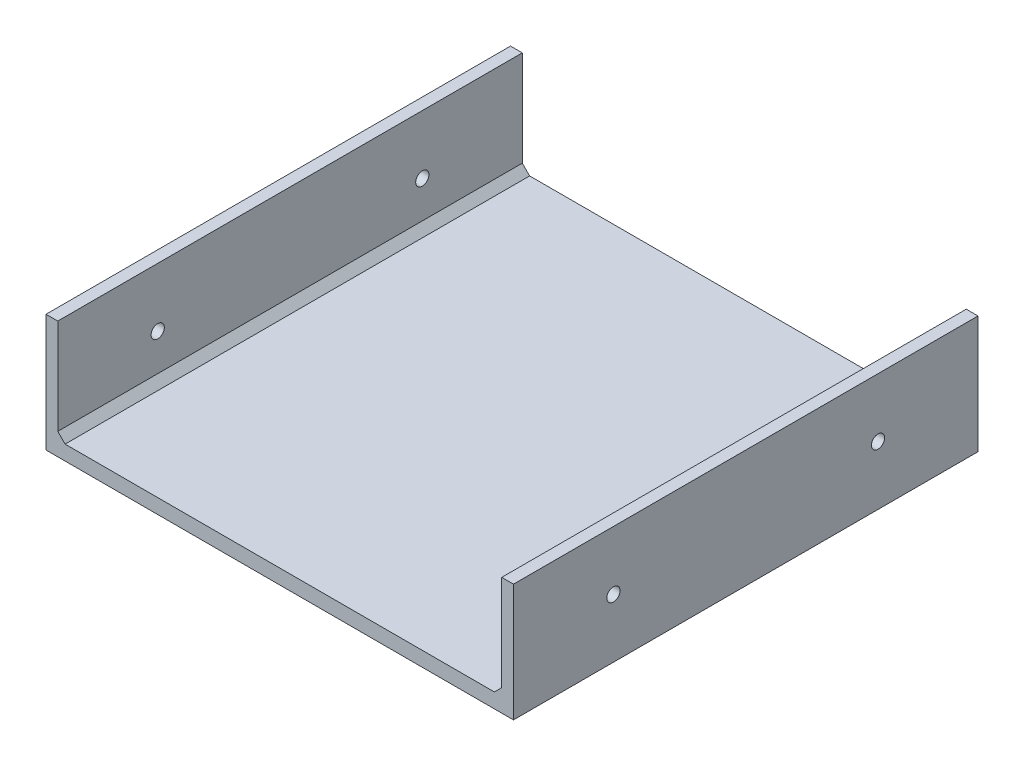
ISO-10303-21;
HEADER;
FILE_DESCRIPTION(('STEP AP214'),'2;1');
FILE_NAME('part.step','',(''),(''),'','','');
FILE_SCHEMA(('AUTOMOTIVE_DESIGN { 1 0 10303 214 1 1 1 1 }'));
ENDSEC;
DATA;
#1=APPLICATION_CONTEXT('core data for automotive mechanical design processes');
#2=APPLICATION_PROTOCOL_DEFINITION('international standard','automotive_design',2000,#1);
#3=PRODUCT_CONTEXT('',#1,'mechanical');
#4=PRODUCT('Part','Part','',(#3));
#5=PRODUCT_RELATED_PRODUCT_CATEGORY('part','',(#4));
#6=PRODUCT_DEFINITION_FORMATION('','',#4);
#7=PRODUCT_DEFINITION_CONTEXT('part definition',#1,'design');
#8=PRODUCT_DEFINITION('design','',#6,#7);
#9=PRODUCT_DEFINITION_SHAPE('','',#8);
#10=(LENGTH_UNIT() NAMED_UNIT(*) SI_UNIT(.MILLI.,.METRE.));
#11=(NAMED_UNIT(*) PLANE_ANGLE_UNIT() SI_UNIT($,.RADIAN.));
#12=(NAMED_UNIT(*) SI_UNIT($,.STERADIAN.) SOLID_ANGLE_UNIT());
#13=UNCERTAINTY_MEASURE_WITH_UNIT(LENGTH_MEASURE(1.E-05),#10,'distance_accuracy_value','');
#14=(GEOMETRIC_REPRESENTATION_CONTEXT(3) GLOBAL_UNCERTAINTY_ASSIGNED_CONTEXT((#13)) GLOBAL_UNIT_ASSIGNED_CONTEXT((#10,
#11,#12)) REPRESENTATION_CONTEXT('',''));
#15=CARTESIAN_POINT('',(0.,0.,0.));
#16=DIRECTION('',(0.,0.,1.));
#17=DIRECTION('',(1.,0.,0.));
#18=AXIS2_PLACEMENT_3D('',#15,#16,#17);
#19=CARTESIAN_POINT('',(-79.5,5.,0.));
#20=DIRECTION('',(1.,0.,0.));
#21=DIRECTION('',(0.,0.,-1.));
#22=AXIS2_PLACEMENT_3D('',#19,#20,#21);
#23=PLANE('',#22);
#24=CARTESIAN_POINT('',(-79.5,20.,34.));
#25=DIRECTION('',(1.,0.,0.));
#26=DIRECTION('',(0.,0.,-1.));
#27=AXIS2_PLACEMENT_3D('',#24,#25,#26);
#28=CIRCLE('',#27,2.25);
#29=CARTESIAN_POINT('',(-79.5,20.,31.75));
#30=VERTEX_POINT('',#29);
#31=EDGE_CURVE('E252',#30,#30,#28,.T.);
#32=ORIENTED_EDGE('',*,*,#31,.T.);
#33=EDGE_LOOP('',(#32));
#34=FACE_BOUND('',#33,.T.);
#35=CARTESIAN_POINT('',(-79.5,20.,124.));
#36=DIRECTION('',(1.,0.,0.));
#37=DIRECTION('',(0.,0.,-1.));
#38=AXIS2_PLACEMENT_3D('',#35,#36,#37);
#39=CIRCLE('',#38,2.25);
#40=CARTESIAN_POINT('',(-79.5,20.,121.75));
#41=VERTEX_POINT('',#40);
#42=EDGE_CURVE('E146',#41,#41,#39,.T.);
#43=ORIENTED_EDGE('',*,*,#42,.T.);
#44=EDGE_LOOP('',(#43));
#45=FACE_BOUND('',#44,.T.);
#46=DIRECTION('',(0.,0.,1.));
#47=VECTOR('',#46,1.);
#48=CARTESIAN_POINT('',(-79.5,0.,0.));
#49=LINE('',#48,#47);
#50=CARTESIAN_POINT('',(-79.5,0.,0.));
#51=VERTEX_POINT('',#50);
#52=CARTESIAN_POINT('',(-79.5,0.,158.));
#53=VERTEX_POINT('',#52);
#54=EDGE_CURVE('E131',#51,#53,#49,.T.);
#55=ORIENTED_EDGE('',*,*,#54,.T.);
#56=DIRECTION('',(0.,-1.,0.));
#57=VECTOR('',#56,1.);
#58=CARTESIAN_POINT('',(-79.5,5.,158.));
#59=LINE('',#58,#57);
#60=CARTESIAN_POINT('',(-79.5,40.,158.));
#61=VERTEX_POINT('',#60);
#62=EDGE_CURVE('E125',#61,#53,#59,.T.);
#63=ORIENTED_EDGE('',*,*,#62,.F.);
#64=DIRECTION('',(0.,0.,-1.));
#65=VECTOR('',#64,1.);
#66=CARTESIAN_POINT('',(-79.5,40.,158.));
#67=LINE('',#66,#65);
#68=CARTESIAN_POINT('',(-79.5,40.,0.));
#69=VERTEX_POINT('',#68);
#70=EDGE_CURVE('E128',#61,#69,#67,.T.);
#71=ORIENTED_EDGE('',*,*,#70,.T.);
#72=DIRECTION('',(0.,-1.,0.));
#73=VECTOR('',#72,1.);
#74=CARTESIAN_POINT('',(-79.5,5.,0.));
#75=LINE('',#74,#73);
#76=EDGE_CURVE('E212',#69,#51,#75,.T.);
#77=ORIENTED_EDGE('',*,*,#76,.T.);
#78=EDGE_LOOP('',(#55,#63,#71,#77));
#79=FACE_BOUND('',#78,.T.);
#80=ADVANCED_FACE('F47',(#34,#45,#79),#23,.F.);
#81=CARTESIAN_POINT('',(-79.5,5.,158.));
#82=DIRECTION('',(0.,0.,-1.));
#83=DIRECTION('',(-1.,0.,0.));
#84=AXIS2_PLACEMENT_3D('',#81,#82,#83);
#85=PLANE('',#84);
#86=DIRECTION('',(1.,0.,0.));
#87=VECTOR('',#86,1.);
#88=CARTESIAN_POINT('',(-79.5,0.,158.));
#89=LINE('',#88,#87);
#90=CARTESIAN_POINT('',(79.5,0.,158.));
#91=VERTEX_POINT('',#90);
#92=EDGE_CURVE('E215',#53,#91,#89,.T.);
#93=ORIENTED_EDGE('',*,*,#92,.T.);
#94=DIRECTION('',(0.,-1.,0.));
#95=VECTOR('',#94,1.);
#96=CARTESIAN_POINT('',(79.5,5.,158.));
#97=LINE('',#96,#95);
#98=CARTESIAN_POINT('',(79.5,40.,158.));
#99=VERTEX_POINT('',#98);
#100=EDGE_CURVE('E135',#99,#91,#97,.T.);
#101=ORIENTED_EDGE('',*,*,#100,.F.);
#102=DIRECTION('',(1.,0.,0.));
#103=VECTOR('',#102,1.);
#104=CARTESIAN_POINT('',(79.5,40.,158.));
#105=LINE('',#104,#103);
#106=CARTESIAN_POINT('',(75.5,40.,158.));
#107=VERTEX_POINT('',#106);
#108=EDGE_CURVE('E192',#107,#99,#105,.T.);
#109=ORIENTED_EDGE('',*,*,#108,.F.);
#110=DIRECTION('',(0.,-1.,0.));
#111=VECTOR('',#110,1.);
#112=CARTESIAN_POINT('',(75.5,40.,158.));
#113=LINE('',#112,#111);
#114=CARTESIAN_POINT('',(75.5,7.50000000000003,158.));
#115=VERTEX_POINT('',#114);
#116=EDGE_CURVE('E196',#107,#115,#113,.T.);
#117=ORIENTED_EDGE('',*,*,#116,.T.);
#118=DIRECTION('',(-0.707106781186544,-0.707106781186551,0.));
#119=VECTOR('',#118,1.);
#120=CARTESIAN_POINT('',(-3.24999999999921,-71.25,158.));
#121=LINE('',#120,#119);
#122=CARTESIAN_POINT('',(73.,5.,158.));
#123=VERTEX_POINT('',#122);
#124=EDGE_CURVE('E244',#115,#123,#121,.T.);
#125=ORIENTED_EDGE('',*,*,#124,.T.);
#126=DIRECTION('',(1.,0.,0.));
#127=VECTOR('',#126,1.);
#128=CARTESIAN_POINT('',(-79.5,5.,158.));
#129=LINE('',#128,#127);
#130=CARTESIAN_POINT('',(-72.9999999999999,5.,158.));
#131=VERTEX_POINT('',#130);
#132=EDGE_CURVE('E204',#131,#123,#129,.T.);
#133=ORIENTED_EDGE('',*,*,#132,.F.);
#134=DIRECTION('',(0.707106781186552,-0.707106781186543,0.));
#135=VECTOR('',#134,1.);
#136=CARTESIAN_POINT('',(-76.25,8.25000000000002,158.));
#137=LINE('',#136,#135);
#138=CARTESIAN_POINT('',(-75.5,7.5,158.));
#139=VERTEX_POINT('',#138);
#140=EDGE_CURVE('E57',#131,#139,#137,.F.);
#141=ORIENTED_EDGE('',*,*,#140,.T.);
#142=DIRECTION('',(0.,-1.,0.));
#143=VECTOR('',#142,1.);
#144=CARTESIAN_POINT('',(-75.5,40.,158.));
#145=LINE('',#144,#143);
#146=CARTESIAN_POINT('',(-75.5,40.,158.));
#147=VERTEX_POINT('',#146);
#148=EDGE_CURVE('E149',#147,#139,#145,.T.);
#149=ORIENTED_EDGE('',*,*,#148,.F.);
#150=DIRECTION('',(-1.,0.,0.));
#151=VECTOR('',#150,1.);
#152=CARTESIAN_POINT('',(-79.5,40.,158.));
#153=LINE('',#152,#151);
#154=EDGE_CURVE('E141',#147,#61,#153,.T.);
#155=ORIENTED_EDGE('',*,*,#154,.T.);
#156=ORIENTED_EDGE('',*,*,#62,.T.);
#157=EDGE_LOOP('',(#93,#101,#109,#117,#125,#133,#141,#149,#155,#156));
#158=FACE_BOUND('',#157,.T.);
#159=ADVANCED_FACE('F148',(#158),#85,.F.);
#160=CARTESIAN_POINT('',(79.5,5.,0.));
#161=DIRECTION('',(-1.,0.,0.));
#162=DIRECTION('',(0.,0.,1.));
#163=AXIS2_PLACEMENT_3D('',#160,#161,#162);
#164=PLANE('',#163);
#165=CARTESIAN_POINT('',(79.5,20.,34.));
#166=DIRECTION('',(-1.,0.,0.));
#167=DIRECTION('',(0.,0.,1.));
#168=AXIS2_PLACEMENT_3D('',#165,#166,#167);
#169=CIRCLE('',#168,2.25);
#170=CARTESIAN_POINT('',(79.5,20.,36.25));
#171=VERTEX_POINT('',#170);
#172=EDGE_CURVE('E170',#171,#171,#169,.T.);
#173=ORIENTED_EDGE('',*,*,#172,.T.);
#174=EDGE_LOOP('',(#173));
#175=FACE_BOUND('',#174,.T.);
#176=CARTESIAN_POINT('',(79.5,20.,124.));
#177=DIRECTION('',(-1.,0.,0.));
#178=DIRECTION('',(0.,0.,1.));
#179=AXIS2_PLACEMENT_3D('',#176,#177,#178);
#180=CIRCLE('',#179,2.25);
#181=CARTESIAN_POINT('',(79.5,20.,126.25));
#182=VERTEX_POINT('',#181);
#183=EDGE_CURVE('E178',#182,#182,#180,.T.);
#184=ORIENTED_EDGE('',*,*,#183,.T.);
#185=EDGE_LOOP('',(#184));
#186=FACE_BOUND('',#185,.T.);
#187=DIRECTION('',(0.,0.,-1.));
#188=VECTOR('',#187,1.);
#189=CARTESIAN_POINT('',(79.5,0.,0.));
#190=LINE('',#189,#188);
#191=CARTESIAN_POINT('',(79.5,0.,0.));
#192=VERTEX_POINT('',#191);
#193=EDGE_CURVE('E218',#91,#192,#190,.T.);
#194=ORIENTED_EDGE('',*,*,#193,.T.);
#195=DIRECTION('',(0.,-1.,0.));
#196=VECTOR('',#195,1.);
#197=CARTESIAN_POINT('',(79.5,5.,0.));
#198=LINE('',#197,#196);
#199=CARTESIAN_POINT('',(79.5,40.,0.));
#200=VERTEX_POINT('',#199);
#201=EDGE_CURVE('E225',#200,#192,#198,.T.);
#202=ORIENTED_EDGE('',*,*,#201,.F.);
#203=DIRECTION('',(0.,0.,-1.));
#204=VECTOR('',#203,1.);
#205=CARTESIAN_POINT('',(79.5,40.,158.));
#206=LINE('',#205,#204);
#207=EDGE_CURVE('E182',#99,#200,#206,.T.);
#208=ORIENTED_EDGE('',*,*,#207,.F.);
#209=ORIENTED_EDGE('',*,*,#100,.T.);
#210=EDGE_LOOP('',(#194,#202,#208,#209));
#211=FACE_BOUND('',#210,.T.);
#212=ADVANCED_FACE('F302',(#175,#186,#211),#164,.F.);
#213=CARTESIAN_POINT('',(-79.5,5.,0.));
#214=DIRECTION('',(0.,0.,1.));
#215=DIRECTION('',(1.,0.,0.));
#216=AXIS2_PLACEMENT_3D('',#213,#214,#215);
#217=PLANE('',#216);
#218=DIRECTION('',(-1.,0.,0.));
#219=VECTOR('',#218,1.);
#220=CARTESIAN_POINT('',(-79.5,0.,0.));
#221=LINE('',#220,#219);
#222=EDGE_CURVE('E209',#192,#51,#221,.T.);
#223=ORIENTED_EDGE('',*,*,#222,.T.);
#224=ORIENTED_EDGE('',*,*,#76,.F.);
#225=DIRECTION('',(1.,0.,0.));
#226=VECTOR('',#225,1.);
#227=CARTESIAN_POINT('',(-79.5,40.,0.));
#228=LINE('',#227,#226);
#229=CARTESIAN_POINT('',(-75.5,40.,0.));
#230=VERTEX_POINT('',#229);
#231=EDGE_CURVE('E144',#69,#230,#228,.T.);
#232=ORIENTED_EDGE('',*,*,#231,.T.);
#233=DIRECTION('',(0.,-1.,0.));
#234=VECTOR('',#233,1.);
#235=CARTESIAN_POINT('',(-75.5,40.,0.));
#236=LINE('',#235,#234);
#237=CARTESIAN_POINT('',(-75.5,7.5,0.));
#238=VERTEX_POINT('',#237);
#239=EDGE_CURVE('E161',#230,#238,#236,.T.);
#240=ORIENTED_EDGE('',*,*,#239,.T.);
#241=DIRECTION('',(-0.707106781186552,0.707106781186543,0.));
#242=VECTOR('',#241,1.);
#243=CARTESIAN_POINT('',(-76.25,8.25000000000001,0.));
#244=LINE('',#243,#242);
#245=CARTESIAN_POINT('',(-73.,5.,0.));
#246=VERTEX_POINT('',#245);
#247=EDGE_CURVE('E11',#238,#246,#244,.F.);
#248=ORIENTED_EDGE('',*,*,#247,.T.);
#249=DIRECTION('',(-1.,0.,0.));
#250=VECTOR('',#249,1.);
#251=CARTESIAN_POINT('',(-79.5,5.,0.));
#252=LINE('',#251,#250);
#253=CARTESIAN_POINT('',(73.,5.,0.));
#254=VERTEX_POINT('',#253);
#255=EDGE_CURVE('E208',#254,#246,#252,.T.);
#256=ORIENTED_EDGE('',*,*,#255,.F.);
#257=DIRECTION('',(0.707106781186544,0.707106781186551,0.));
#258=VECTOR('',#257,1.);
#259=CARTESIAN_POINT('',(-3.24999999999923,-71.25,0.));
#260=LINE('',#259,#258);
#261=CARTESIAN_POINT('',(75.5,7.50000000000003,0.));
#262=VERTEX_POINT('',#261);
#263=EDGE_CURVE('E247',#254,#262,#260,.T.);
#264=ORIENTED_EDGE('',*,*,#263,.T.);
#265=DIRECTION('',(0.,-1.,0.));
#266=VECTOR('',#265,1.);
#267=CARTESIAN_POINT('',(75.5,40.,0.));
#268=LINE('',#267,#266);
#269=CARTESIAN_POINT('',(75.5,40.,0.));
#270=VERTEX_POINT('',#269);
#271=EDGE_CURVE('E200',#270,#262,#268,.T.);
#272=ORIENTED_EDGE('',*,*,#271,.F.);
#273=DIRECTION('',(-1.,0.,0.));
#274=VECTOR('',#273,1.);
#275=CARTESIAN_POINT('',(79.5,40.,0.));
#276=LINE('',#275,#274);
#277=EDGE_CURVE('E186',#200,#270,#276,.T.);
#278=ORIENTED_EDGE('',*,*,#277,.F.);
#279=ORIENTED_EDGE('',*,*,#201,.T.);
#280=EDGE_LOOP('',(#223,#224,#232,#240,#248,#256,#264,#272,#278,#279));
#281=FACE_BOUND('',#280,.T.);
#282=ADVANCED_FACE('F279',(#281),#217,.F.);
#283=CARTESIAN_POINT('',(0.,5.,0.));
#284=DIRECTION('',(0.,1.,0.));
#285=DIRECTION('',(0.,0.,1.));
#286=AXIS2_PLACEMENT_3D('',#283,#284,#285);
#287=PLANE('',#286);
#288=ORIENTED_EDGE('',*,*,#132,.T.);
#289=DIRECTION('',(0.,0.,-1.));
#290=VECTOR('',#289,1.);
#291=CARTESIAN_POINT('',(73.,5.,0.));
#292=LINE('',#291,#290);
#293=EDGE_CURVE('E239',#123,#254,#292,.T.);
#294=ORIENTED_EDGE('',*,*,#293,.T.);
#295=ORIENTED_EDGE('',*,*,#255,.T.);
#296=DIRECTION('',(0.,0.,1.));
#297=VECTOR('',#296,1.);
#298=CARTESIAN_POINT('',(-72.9999999999999,5.,158.));
#299=LINE('',#298,#297);
#300=EDGE_CURVE('E235',#246,#131,#299,.T.);
#301=ORIENTED_EDGE('',*,*,#300,.T.);
#302=EDGE_LOOP('',(#288,#294,#295,#301));
#303=FACE_BOUND('',#302,.T.);
#304=ADVANCED_FACE('F282',(#303),#287,.T.);
#305=CARTESIAN_POINT('',(0.,0.,0.));
#306=DIRECTION('',(0.,1.,0.));
#307=DIRECTION('',(0.,0.,1.));
#308=AXIS2_PLACEMENT_3D('',#305,#306,#307);
#309=PLANE('',#308);
#310=ORIENTED_EDGE('',*,*,#54,.F.);
#311=ORIENTED_EDGE('',*,*,#222,.F.);
#312=ORIENTED_EDGE('',*,*,#193,.F.);
#313=ORIENTED_EDGE('',*,*,#92,.F.);
#314=EDGE_LOOP('',(#310,#311,#312,#313));
#315=FACE_BOUND('',#314,.T.);
#316=ADVANCED_FACE('F301',(#315),#309,.F.);
#317=CARTESIAN_POINT('',(75.5,40.,158.));
#318=DIRECTION('',(1.,0.,0.));
#319=DIRECTION('',(0.,0.,-1.));
#320=AXIS2_PLACEMENT_3D('',#317,#318,#319);
#321=PLANE('',#320);
#322=CARTESIAN_POINT('',(75.5,20.,34.));
#323=DIRECTION('',(-1.,0.,0.));
#324=DIRECTION('',(0.,0.,1.));
#325=AXIS2_PLACEMENT_3D('',#322,#323,#324);
#326=CIRCLE('',#325,2.25);
#327=CARTESIAN_POINT('',(75.5,20.,36.25));
#328=VERTEX_POINT('',#327);
#329=EDGE_CURVE('E166',#328,#328,#326,.T.);
#330=ORIENTED_EDGE('',*,*,#329,.F.);
#331=EDGE_LOOP('',(#330));
#332=FACE_BOUND('',#331,.T.);
#333=CARTESIAN_POINT('',(75.5,20.,124.));
#334=DIRECTION('',(-1.,0.,0.));
#335=DIRECTION('',(0.,0.,1.));
#336=AXIS2_PLACEMENT_3D('',#333,#334,#335);
#337=CIRCLE('',#336,2.25);
#338=CARTESIAN_POINT('',(75.5,20.,126.25));
#339=VERTEX_POINT('',#338);
#340=EDGE_CURVE('E174',#339,#339,#337,.T.);
#341=ORIENTED_EDGE('',*,*,#340,.F.);
#342=EDGE_LOOP('',(#341));
#343=FACE_BOUND('',#342,.T.);
#344=ORIENTED_EDGE('',*,*,#271,.T.);
#345=DIRECTION('',(0.,0.,1.));
#346=VECTOR('',#345,1.);
#347=CARTESIAN_POINT('',(75.5,7.50000000000003,158.));
#348=LINE('',#347,#346);
#349=EDGE_CURVE('E134',#262,#115,#348,.T.);
#350=ORIENTED_EDGE('',*,*,#349,.T.);
#351=ORIENTED_EDGE('',*,*,#116,.F.);
#352=DIRECTION('',(0.,0.,1.));
#353=VECTOR('',#352,1.);
#354=CARTESIAN_POINT('',(75.5,40.,158.));
#355=LINE('',#354,#353);
#356=EDGE_CURVE('E189',#270,#107,#355,.T.);
#357=ORIENTED_EDGE('',*,*,#356,.F.);
#358=EDGE_LOOP('',(#344,#350,#351,#357));
#359=FACE_BOUND('',#358,.T.);
#360=ADVANCED_FACE('F291',(#332,#343,#359),#321,.F.);
#361=CARTESIAN_POINT('',(0.,40.,0.));
#362=DIRECTION('',(0.,1.,0.));
#363=DIRECTION('',(0.,0.,1.));
#364=AXIS2_PLACEMENT_3D('',#361,#362,#363);
#365=PLANE('',#364);
#366=ORIENTED_EDGE('',*,*,#207,.T.);
#367=ORIENTED_EDGE('',*,*,#277,.T.);
#368=ORIENTED_EDGE('',*,*,#356,.T.);
#369=ORIENTED_EDGE('',*,*,#108,.T.);
#370=EDGE_LOOP('',(#366,#367,#368,#369));
#371=FACE_BOUND('',#370,.T.);
#372=ADVANCED_FACE('F295',(#371),#365,.T.);
#373=CARTESIAN_POINT('',(75.5,20.,124.));
#374=DIRECTION('',(-1.,0.,0.));
#375=DIRECTION('',(0.,0.,1.));
#376=AXIS2_PLACEMENT_3D('',#373,#374,#375);
#377=CYLINDRICAL_SURFACE('',#376,2.25);
#378=ORIENTED_EDGE('',*,*,#183,.F.);
#379=EDGE_LOOP('',(#378));
#380=FACE_BOUND('',#379,.T.);
#381=ORIENTED_EDGE('',*,*,#340,.T.);
#382=EDGE_LOOP('',(#381));
#383=FACE_BOUND('',#382,.T.);
#384=ADVANCED_FACE('F337',(#380,#383),#377,.F.);
#385=CARTESIAN_POINT('',(75.5,20.,34.));
#386=DIRECTION('',(-1.,0.,0.));
#387=DIRECTION('',(0.,0.,1.));
#388=AXIS2_PLACEMENT_3D('',#385,#386,#387);
#389=CYLINDRICAL_SURFACE('',#388,2.25);
#390=ORIENTED_EDGE('',*,*,#172,.F.);
#391=EDGE_LOOP('',(#390));
#392=FACE_BOUND('',#391,.T.);
#393=ORIENTED_EDGE('',*,*,#329,.T.);
#394=EDGE_LOOP('',(#393));
#395=FACE_BOUND('',#394,.T.);
#396=ADVANCED_FACE('F272',(#392,#395),#389,.F.);
#397=CARTESIAN_POINT('',(-75.5,40.,158.));
#398=DIRECTION('',(1.,0.,0.));
#399=DIRECTION('',(0.,0.,-1.));
#400=AXIS2_PLACEMENT_3D('',#397,#398,#399);
#401=PLANE('',#400);
#402=CARTESIAN_POINT('',(-75.5,20.,34.));
#403=DIRECTION('',(1.,0.,0.));
#404=DIRECTION('',(0.,0.,-1.));
#405=AXIS2_PLACEMENT_3D('',#402,#403,#404);
#406=CIRCLE('',#405,2.25);
#407=CARTESIAN_POINT('',(-75.5,20.,31.75));
#408=VERTEX_POINT('',#407);
#409=EDGE_CURVE('E260',#408,#408,#406,.T.);
#410=ORIENTED_EDGE('',*,*,#409,.F.);
#411=EDGE_LOOP('',(#410));
#412=FACE_BOUND('',#411,.T.);
#413=CARTESIAN_POINT('',(-75.5,20.,124.));
#414=DIRECTION('',(1.,0.,0.));
#415=DIRECTION('',(0.,0.,-1.));
#416=AXIS2_PLACEMENT_3D('',#413,#414,#415);
#417=CIRCLE('',#416,2.25);
#418=CARTESIAN_POINT('',(-75.5,20.,121.75));
#419=VERTEX_POINT('',#418);
#420=EDGE_CURVE('E250',#419,#419,#417,.T.);
#421=ORIENTED_EDGE('',*,*,#420,.F.);
#422=EDGE_LOOP('',(#421));
#423=FACE_BOUND('',#422,.T.);
#424=ORIENTED_EDGE('',*,*,#148,.T.);
#425=DIRECTION('',(0.,0.,-1.));
#426=VECTOR('',#425,1.);
#427=CARTESIAN_POINT('',(-75.5,7.5,0.));
#428=LINE('',#427,#426);
#429=EDGE_CURVE('E70',#139,#238,#428,.T.);
#430=ORIENTED_EDGE('',*,*,#429,.T.);
#431=ORIENTED_EDGE('',*,*,#239,.F.);
#432=DIRECTION('',(0.,0.,1.));
#433=VECTOR('',#432,1.);
#434=CARTESIAN_POINT('',(-75.5,40.,158.));
#435=LINE('',#434,#433);
#436=EDGE_CURVE('E151',#230,#147,#435,.T.);
#437=ORIENTED_EDGE('',*,*,#436,.T.);
#438=EDGE_LOOP('',(#424,#430,#431,#437));
#439=FACE_BOUND('',#438,.T.);
#440=ADVANCED_FACE('F269',(#412,#423,#439),#401,.T.);
#441=CARTESIAN_POINT('',(0.,40.,0.));
#442=DIRECTION('',(0.,1.,0.));
#443=DIRECTION('',(0.,0.,1.));
#444=AXIS2_PLACEMENT_3D('',#441,#442,#443);
#445=PLANE('',#444);
#446=ORIENTED_EDGE('',*,*,#70,.F.);
#447=ORIENTED_EDGE('',*,*,#154,.F.);
#448=ORIENTED_EDGE('',*,*,#436,.F.);
#449=ORIENTED_EDGE('',*,*,#231,.F.);
#450=EDGE_LOOP('',(#446,#447,#448,#449));
#451=FACE_BOUND('',#450,.T.);
#452=ADVANCED_FACE('F139',(#451),#445,.T.);
#453=CARTESIAN_POINT('',(-75.5,20.,124.));
#454=DIRECTION('',(1.,0.,0.));
#455=DIRECTION('',(0.,0.,-1.));
#456=AXIS2_PLACEMENT_3D('',#453,#454,#455);
#457=CYLINDRICAL_SURFACE('',#456,2.25);
#458=ORIENTED_EDGE('',*,*,#42,.F.);
#459=EDGE_LOOP('',(#458));
#460=FACE_BOUND('',#459,.T.);
#461=ORIENTED_EDGE('',*,*,#420,.T.);
#462=EDGE_LOOP('',(#461));
#463=FACE_BOUND('',#462,.T.);
#464=ADVANCED_FACE('F324',(#460,#463),#457,.F.);
#465=CARTESIAN_POINT('',(-75.5,20.,34.));
#466=DIRECTION('',(1.,0.,0.));
#467=DIRECTION('',(0.,0.,-1.));
#468=AXIS2_PLACEMENT_3D('',#465,#466,#467);
#469=CYLINDRICAL_SURFACE('',#468,2.25);
#470=ORIENTED_EDGE('',*,*,#31,.F.);
#471=EDGE_LOOP('',(#470));
#472=FACE_BOUND('',#471,.T.);
#473=ORIENTED_EDGE('',*,*,#409,.T.);
#474=EDGE_LOOP('',(#473));
#475=FACE_BOUND('',#474,.T.);
#476=ADVANCED_FACE('F267',(#472,#475),#469,.F.);
#477=CARTESIAN_POINT('',(75.5,7.50000000000003,158.));
#478=DIRECTION('',(0.707106781186551,-0.707106781186544,0.));
#479=DIRECTION('',(0.,0.,1.));
#480=AXIS2_PLACEMENT_3D('',#477,#478,#479);
#481=PLANE('',#480);
#482=ORIENTED_EDGE('',*,*,#263,.F.);
#483=ORIENTED_EDGE('',*,*,#293,.F.);
#484=ORIENTED_EDGE('',*,*,#124,.F.);
#485=ORIENTED_EDGE('',*,*,#349,.F.);
#486=EDGE_LOOP('',(#482,#483,#484,#485));
#487=FACE_BOUND('',#486,.T.);
#488=ADVANCED_FACE('F285',(#487),#481,.F.);
#489=CARTESIAN_POINT('',(-73.,5.,0.));
#490=DIRECTION('',(0.707106781186543,0.707106781186552,0.));
#491=DIRECTION('',(0.,0.,-1.));
#492=AXIS2_PLACEMENT_3D('',#489,#490,#491);
#493=PLANE('',#492);
#494=ORIENTED_EDGE('',*,*,#247,.F.);
#495=ORIENTED_EDGE('',*,*,#429,.F.);
#496=ORIENTED_EDGE('',*,*,#140,.F.);
#497=ORIENTED_EDGE('',*,*,#300,.F.);
#498=EDGE_LOOP('',(#494,#495,#496,#497));
#499=FACE_BOUND('',#498,.T.);
#500=ADVANCED_FACE('F50',(#499),#493,.T.);
#501=CLOSED_SHELL('',(#80,#159,#212,#282,#304,#316,#360,#372,#384,#396,#440,#452,#464,#476,#488,#500));
#502=MANIFOLD_SOLID_BREP('B2',#501);
#503=ADVANCED_BREP_SHAPE_REPRESENTATION('',(#18,#502),#14);
#504=SHAPE_DEFINITION_REPRESENTATION(#9,#503);
ENDSEC;
END-ISO-10303-21;
